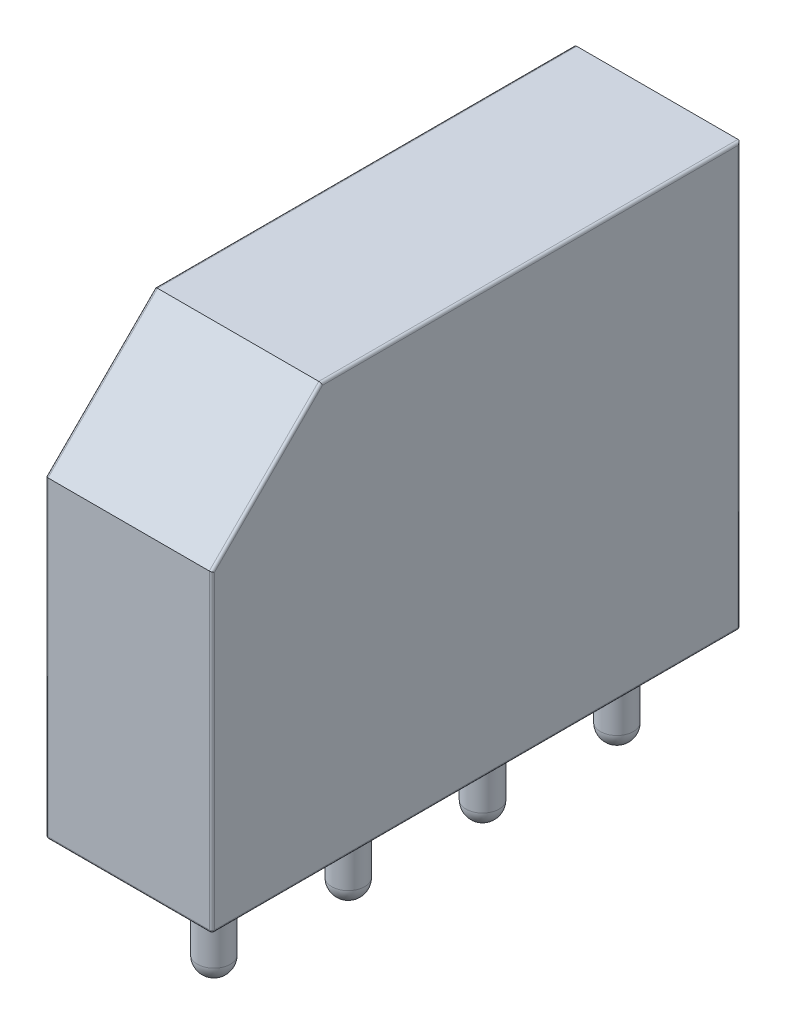
ISO-10303-21;
HEADER;
FILE_DESCRIPTION(('STEP AP214'),'2;1');
FILE_NAME('part.step','',(''),(''),'','','');
FILE_SCHEMA(('AUTOMOTIVE_DESIGN { 1 0 10303 214 1 1 1 1 }'));
ENDSEC;
DATA;
#1=APPLICATION_CONTEXT('core data for automotive mechanical design processes');
#2=APPLICATION_PROTOCOL_DEFINITION('international standard','automotive_design',2000,#1);
#3=PRODUCT_CONTEXT('',#1,'mechanical');
#4=PRODUCT('Part','Part','',(#3));
#5=PRODUCT_RELATED_PRODUCT_CATEGORY('part','',(#4));
#6=PRODUCT_DEFINITION_FORMATION('','',#4);
#7=PRODUCT_DEFINITION_CONTEXT('part definition',#1,'design');
#8=PRODUCT_DEFINITION('design','',#6,#7);
#9=PRODUCT_DEFINITION_SHAPE('','',#8);
#10=(LENGTH_UNIT() NAMED_UNIT(*) SI_UNIT(.MILLI.,.METRE.));
#11=(NAMED_UNIT(*) PLANE_ANGLE_UNIT() SI_UNIT($,.RADIAN.));
#12=(NAMED_UNIT(*) SI_UNIT($,.STERADIAN.) SOLID_ANGLE_UNIT());
#13=UNCERTAINTY_MEASURE_WITH_UNIT(LENGTH_MEASURE(1.E-05),#10,'distance_accuracy_value','');
#14=(GEOMETRIC_REPRESENTATION_CONTEXT(3) GLOBAL_UNCERTAINTY_ASSIGNED_CONTEXT((#13)) GLOBAL_UNIT_ASSIGNED_CONTEXT((#10,
#11,#12)) REPRESENTATION_CONTEXT('',''));
#15=CARTESIAN_POINT('',(0.,0.,0.));
#16=DIRECTION('',(0.,0.,1.));
#17=DIRECTION('',(1.,0.,0.));
#18=AXIS2_PLACEMENT_3D('',#15,#16,#17);
#19=CARTESIAN_POINT('',(-4.,0.,-2.38));
#20=DIRECTION('',(0.,-1.,0.));
#21=DIRECTION('',(0.,0.,-1.));
#22=AXIS2_PLACEMENT_3D('',#19,#20,#21);
#23=PLANE('',#22);
#24=DIRECTION('',(0.,0.,-1.));
#25=VECTOR('',#24,1.);
#26=CARTESIAN_POINT('',(2.2,0.,17.62));
#27=LINE('',#26,#25);
#28=CARTESIAN_POINT('',(2.2,0.,-2.28));
#29=VERTEX_POINT('',#28);
#30=CARTESIAN_POINT('',(2.2,0.,17.52));
#31=VERTEX_POINT('',#30);
#32=EDGE_CURVE('E159',#29,#31,#27,.F.);
#33=ORIENTED_EDGE('',*,*,#32,.T.);
#34=DIRECTION('',(1.,0.,0.));
#35=VECTOR('',#34,1.);
#36=CARTESIAN_POINT('',(-4.,0.,17.52));
#37=LINE('',#36,#35);
#38=CARTESIAN_POINT('',(-3.9,0.,17.52));
#39=VERTEX_POINT('',#38);
#40=EDGE_CURVE('E167',#31,#39,#37,.F.);
#41=ORIENTED_EDGE('',*,*,#40,.T.);
#42=DIRECTION('',(0.,0.,1.));
#43=VECTOR('',#42,1.);
#44=CARTESIAN_POINT('',(-3.9,0.,-2.38));
#45=LINE('',#44,#43);
#46=CARTESIAN_POINT('',(-3.9,0.,-2.28));
#47=VERTEX_POINT('',#46);
#48=EDGE_CURVE('E128',#39,#47,#45,.F.);
#49=ORIENTED_EDGE('',*,*,#48,.T.);
#50=DIRECTION('',(-1.,0.,0.));
#51=VECTOR('',#50,1.);
#52=CARTESIAN_POINT('',(2.3,0.,-2.28));
#53=LINE('',#52,#51);
#54=EDGE_CURVE('E157',#47,#29,#53,.F.);
#55=ORIENTED_EDGE('',*,*,#54,.T.);
#56=EDGE_LOOP('',(#33,#41,#49,#55));
#57=FACE_BOUND('',#56,.T.);
#58=CARTESIAN_POINT('',(0.,0.,10.164));
#59=DIRECTION('',(0.,-1.,0.));
#60=DIRECTION('',(0.,0.,-1.));
#61=AXIS2_PLACEMENT_3D('',#58,#59,#60);
#62=CIRCLE('',#61,0.625000000000001);
#63=CARTESIAN_POINT('',(0.,0.,9.539));
#64=VERTEX_POINT('',#63);
#65=EDGE_CURVE('E249',#64,#64,#62,.T.);
#66=ORIENTED_EDGE('',*,*,#65,.F.);
#67=EDGE_LOOP('',(#66));
#68=FACE_BOUND('',#67,.T.);
#69=CARTESIAN_POINT('',(0.,0.,0.));
#70=DIRECTION('',(0.,-1.,0.));
#71=DIRECTION('',(0.,0.,-1.));
#72=AXIS2_PLACEMENT_3D('',#69,#70,#71);
#73=CIRCLE('',#72,0.625);
#74=CARTESIAN_POINT('',(0.,0.,-0.625));
#75=VERTEX_POINT('',#74);
#76=EDGE_CURVE('E257',#75,#75,#73,.T.);
#77=ORIENTED_EDGE('',*,*,#76,.F.);
#78=EDGE_LOOP('',(#77));
#79=FACE_BOUND('',#78,.T.);
#80=CARTESIAN_POINT('',(0.,0.,5.082));
#81=DIRECTION('',(0.,-1.,0.));
#82=DIRECTION('',(0.,0.,-1.));
#83=AXIS2_PLACEMENT_3D('',#80,#81,#82);
#84=CIRCLE('',#83,0.625);
#85=CARTESIAN_POINT('',(0.,0.,4.457));
#86=VERTEX_POINT('',#85);
#87=EDGE_CURVE('E253',#86,#86,#84,.T.);
#88=ORIENTED_EDGE('',*,*,#87,.F.);
#89=EDGE_LOOP('',(#88));
#90=FACE_BOUND('',#89,.T.);
#91=CARTESIAN_POINT('',(0.,0.,15.246));
#92=DIRECTION('',(0.,-1.,0.));
#93=DIRECTION('',(0.,0.,-1.));
#94=AXIS2_PLACEMENT_3D('',#91,#92,#93);
#95=CIRCLE('',#94,0.625000000000001);
#96=CARTESIAN_POINT('',(0.,0.,14.621));
#97=VERTEX_POINT('',#96);
#98=EDGE_CURVE('E241',#97,#97,#95,.T.);
#99=ORIENTED_EDGE('',*,*,#98,.F.);
#100=EDGE_LOOP('',(#99));
#101=FACE_BOUND('',#100,.T.);
#102=ADVANCED_FACE('F33',(#57,#68,#79,#90,#101),#23,.T.);
#103=CARTESIAN_POINT('',(-4.,16.,17.62));
#104=DIRECTION('',(1.,0.,0.));
#105=DIRECTION('',(0.,0.,-1.));
#106=AXIS2_PLACEMENT_3D('',#103,#104,#105);
#107=PLANE('',#106);
#108=DIRECTION('',(0.,-1.,0.));
#109=VECTOR('',#108,1.);
#110=CARTESIAN_POINT('',(-4.,16.,-2.28));
#111=LINE('',#110,#109);
#112=CARTESIAN_POINT('',(-4.,15.9,-2.28));
#113=VERTEX_POINT('',#112);
#114=CARTESIAN_POINT('',(-4.,0.0999999999999994,-2.28));
#115=VERTEX_POINT('',#114);
#116=EDGE_CURVE('E155',#113,#115,#111,.T.);
#117=ORIENTED_EDGE('',*,*,#116,.T.);
#118=DIRECTION('',(0.,0.,1.));
#119=VECTOR('',#118,1.);
#120=CARTESIAN_POINT('',(-4.,0.0999999999999994,17.62));
#121=LINE('',#120,#119);
#122=CARTESIAN_POINT('',(-4.,0.0999999999999994,17.52));
#123=VERTEX_POINT('',#122);
#124=EDGE_CURVE('E126',#115,#123,#121,.T.);
#125=ORIENTED_EDGE('',*,*,#124,.T.);
#126=DIRECTION('',(0.,-1.,0.));
#127=VECTOR('',#126,1.);
#128=CARTESIAN_POINT('',(-4.,16.,17.52));
#129=LINE('',#128,#127);
#130=CARTESIAN_POINT('',(-4.,11.8171779365371,17.52));
#131=VERTEX_POINT('',#130);
#132=EDGE_CURVE('E144',#123,#131,#129,.F.);
#133=ORIENTED_EDGE('',*,*,#132,.T.);
#134=DIRECTION('',(0.,0.707098244188037,-0.70711531808199));
#135=VECTOR('',#134,1.);
#136=CARTESIAN_POINT('',(-4.,13.8585384687955,15.4785901761848));
#137=LINE('',#136,#135);
#138=CARTESIAN_POINT('',(-4.,15.9,13.4370793509848));
#139=VERTEX_POINT('',#138);
#140=EDGE_CURVE('E150',#131,#139,#137,.T.);
#141=ORIENTED_EDGE('',*,*,#140,.T.);
#142=DIRECTION('',(0.,0.,1.));
#143=VECTOR('',#142,1.);
#144=CARTESIAN_POINT('',(-4.,15.9,17.62));
#145=LINE('',#144,#143);
#146=EDGE_CURVE('E161',#139,#113,#145,.F.);
#147=ORIENTED_EDGE('',*,*,#146,.T.);
#148=EDGE_LOOP('',(#117,#125,#133,#141,#147));
#149=FACE_BOUND('',#148,.T.);
#150=ADVANCED_FACE('F153',(#149),#107,.F.);
#151=CARTESIAN_POINT('',(-4.,16.,17.62));
#152=DIRECTION('',(0.,0.,-1.));
#153=DIRECTION('',(-1.,0.,0.));
#154=AXIS2_PLACEMENT_3D('',#151,#152,#153);
#155=PLANE('',#154);
#156=DIRECTION('',(-1.,0.,0.));
#157=VECTOR('',#156,1.);
#158=CARTESIAN_POINT('',(46.0748308013074,11.8586,17.62));
#159=LINE('',#158,#157);
#160=CARTESIAN_POINT('',(2.19999999999999,11.8586,17.62));
#161=VERTEX_POINT('',#160);
#162=CARTESIAN_POINT('',(-3.9,11.8586,17.62));
#163=VERTEX_POINT('',#162);
#164=EDGE_CURVE('E235',#161,#163,#159,.T.);
#165=ORIENTED_EDGE('',*,*,#164,.T.);
#166=DIRECTION('',(0.,-1.,0.));
#167=VECTOR('',#166,1.);
#168=CARTESIAN_POINT('',(-3.9,16.,17.62));
#169=LINE('',#168,#167);
#170=CARTESIAN_POINT('',(-3.9,0.0999999999999994,17.62));
#171=VERTEX_POINT('',#170);
#172=EDGE_CURVE('E188',#163,#171,#169,.T.);
#173=ORIENTED_EDGE('',*,*,#172,.T.);
#174=DIRECTION('',(1.,0.,0.));
#175=VECTOR('',#174,1.);
#176=CARTESIAN_POINT('',(2.3,0.0999999999999994,17.62));
#177=LINE('',#176,#175);
#178=CARTESIAN_POINT('',(2.2,0.0999999999999994,17.62));
#179=VERTEX_POINT('',#178);
#180=EDGE_CURVE('E184',#171,#179,#177,.T.);
#181=ORIENTED_EDGE('',*,*,#180,.T.);
#182=DIRECTION('',(0.,-1.,0.));
#183=VECTOR('',#182,1.);
#184=CARTESIAN_POINT('',(2.2,16.,17.62));
#185=LINE('',#184,#183);
#186=EDGE_CURVE('E186',#179,#161,#185,.F.);
#187=ORIENTED_EDGE('',*,*,#186,.T.);
#188=EDGE_LOOP('',(#165,#173,#181,#187));
#189=FACE_BOUND('',#188,.T.);
#190=ADVANCED_FACE('F302',(#189),#155,.F.);
#191=CARTESIAN_POINT('',(2.3,16.,17.62));
#192=DIRECTION('',(-1.,0.,0.));
#193=DIRECTION('',(0.,0.,1.));
#194=AXIS2_PLACEMENT_3D('',#191,#192,#193);
#195=PLANE('',#194);
#196=DIRECTION('',(0.,0.,-1.));
#197=VECTOR('',#196,1.);
#198=CARTESIAN_POINT('',(2.3,0.0999999999999994,-2.38));
#199=LINE('',#198,#197);
#200=CARTESIAN_POINT('',(2.3,0.0999999999999994,17.52));
#201=VERTEX_POINT('',#200);
#202=CARTESIAN_POINT('',(2.3,0.0999999999999994,-2.28));
#203=VERTEX_POINT('',#202);
#204=EDGE_CURVE('E42',#201,#203,#199,.T.);
#205=ORIENTED_EDGE('',*,*,#204,.T.);
#206=DIRECTION('',(0.,-1.,0.));
#207=VECTOR('',#206,1.);
#208=CARTESIAN_POINT('',(2.3,16.,-2.28));
#209=LINE('',#208,#207);
#210=CARTESIAN_POINT('',(2.3,15.9,-2.28));
#211=VERTEX_POINT('',#210);
#212=EDGE_CURVE('E11',#203,#211,#209,.F.);
#213=ORIENTED_EDGE('',*,*,#212,.T.);
#214=DIRECTION('',(0.,0.,-1.));
#215=VECTOR('',#214,1.);
#216=CARTESIAN_POINT('',(2.3,15.9,17.62));
#217=LINE('',#216,#215);
#218=CARTESIAN_POINT('',(2.3,15.9,13.4370793509848));
#219=VERTEX_POINT('',#218);
#220=EDGE_CURVE('E190',#211,#219,#217,.F.);
#221=ORIENTED_EDGE('',*,*,#220,.T.);
#222=DIRECTION('',(0.,-0.707098244188037,0.70711531808199));
#223=VECTOR('',#222,1.);
#224=CARTESIAN_POINT('',(2.3,13.8585384687955,15.4785901761848));
#225=LINE('',#224,#223);
#226=CARTESIAN_POINT('',(2.3,11.8171779365371,17.52));
#227=VERTEX_POINT('',#226);
#228=EDGE_CURVE('E192',#219,#227,#225,.T.);
#229=ORIENTED_EDGE('',*,*,#228,.T.);
#230=DIRECTION('',(0.,-1.,0.));
#231=VECTOR('',#230,1.);
#232=CARTESIAN_POINT('',(2.3,16.,17.52));
#233=LINE('',#232,#231);
#234=EDGE_CURVE('E53',#227,#201,#233,.T.);
#235=ORIENTED_EDGE('',*,*,#234,.T.);
#236=EDGE_LOOP('',(#205,#213,#221,#229,#235));
#237=FACE_BOUND('',#236,.T.);
#238=ADVANCED_FACE('F316',(#237),#195,.F.);
#239=CARTESIAN_POINT('',(-4.,16.,-2.38));
#240=DIRECTION('',(0.,0.,1.));
#241=DIRECTION('',(1.,0.,0.));
#242=AXIS2_PLACEMENT_3D('',#239,#240,#241);
#243=PLANE('',#242);
#244=DIRECTION('',(-1.,0.,0.));
#245=VECTOR('',#244,1.);
#246=CARTESIAN_POINT('',(-4.,0.0999999999999994,-2.38));
#247=LINE('',#246,#245);
#248=CARTESIAN_POINT('',(2.2,0.0999999999999994,-2.38));
#249=VERTEX_POINT('',#248);
#250=CARTESIAN_POINT('',(-3.9,0.0999999999999994,-2.38));
#251=VERTEX_POINT('',#250);
#252=EDGE_CURVE('E169',#249,#251,#247,.T.);
#253=ORIENTED_EDGE('',*,*,#252,.T.);
#254=DIRECTION('',(0.,-1.,0.));
#255=VECTOR('',#254,1.);
#256=CARTESIAN_POINT('',(-3.9,16.,-2.38));
#257=LINE('',#256,#255);
#258=CARTESIAN_POINT('',(-3.9,16.,-2.38));
#259=VERTEX_POINT('',#258);
#260=EDGE_CURVE('E173',#251,#259,#257,.F.);
#261=ORIENTED_EDGE('',*,*,#260,.T.);
#262=DIRECTION('',(-1.,0.,0.));
#263=VECTOR('',#262,1.);
#264=CARTESIAN_POINT('',(-4.,16.,-2.38));
#265=LINE('',#264,#263);
#266=CARTESIAN_POINT('',(2.2,16.,-2.38));
#267=VERTEX_POINT('',#266);
#268=EDGE_CURVE('E261',#267,#259,#265,.T.);
#269=ORIENTED_EDGE('',*,*,#268,.F.);
#270=DIRECTION('',(0.,-1.,0.));
#271=VECTOR('',#270,1.);
#272=CARTESIAN_POINT('',(2.2,16.,-2.38));
#273=LINE('',#272,#271);
#274=EDGE_CURVE('E171',#267,#249,#273,.T.);
#275=ORIENTED_EDGE('',*,*,#274,.T.);
#276=EDGE_LOOP('',(#253,#261,#269,#275));
#277=FACE_BOUND('',#276,.T.);
#278=ADVANCED_FACE('F327',(#277),#243,.F.);
#279=CARTESIAN_POINT('',(-4.,16.,-2.38));
#280=DIRECTION('',(0.,-1.,0.));
#281=DIRECTION('',(0.,0.,-1.));
#282=AXIS2_PLACEMENT_3D('',#279,#280,#281);
#283=PLANE('',#282);
#284=ORIENTED_EDGE('',*,*,#268,.T.);
#285=DIRECTION('',(0.,0.,1.));
#286=VECTOR('',#285,1.);
#287=CARTESIAN_POINT('',(-3.9,16.,-2.38));
#288=LINE('',#287,#286);
#289=CARTESIAN_POINT('',(-3.9,16.,13.4785));
#290=VERTEX_POINT('',#289);
#291=EDGE_CURVE('E178',#259,#290,#288,.T.);
#292=ORIENTED_EDGE('',*,*,#291,.T.);
#293=DIRECTION('',(1.,0.,0.));
#294=VECTOR('',#293,1.);
#295=CARTESIAN_POINT('',(-4.,16.,13.4785));
#296=LINE('',#295,#294);
#297=CARTESIAN_POINT('',(2.2,16.,13.4785));
#298=VERTEX_POINT('',#297);
#299=EDGE_CURVE('E151',#290,#298,#296,.T.);
#300=ORIENTED_EDGE('',*,*,#299,.T.);
#301=DIRECTION('',(0.,0.,-1.));
#302=VECTOR('',#301,1.);
#303=CARTESIAN_POINT('',(2.2,16.,-2.38));
#304=LINE('',#303,#302);
#305=EDGE_CURVE('E176',#298,#267,#304,.T.);
#306=ORIENTED_EDGE('',*,*,#305,.T.);
#307=EDGE_LOOP('',(#284,#292,#300,#306));
#308=FACE_BOUND('',#307,.T.);
#309=ADVANCED_FACE('F324',(#308),#283,.F.);
#310=CARTESIAN_POINT('',(0.,-3.,0.));
#311=DIRECTION('',(0.,1.,0.));
#312=DIRECTION('',(0.,0.,1.));
#313=AXIS2_PLACEMENT_3D('',#310,#311,#312);
#314=CYLINDRICAL_SURFACE('',#313,0.625);
#315=CARTESIAN_POINT('',(0.,-3.,0.));
#316=DIRECTION('',(0.,-1.,0.));
#317=DIRECTION('',(0.,0.,-1.));
#318=AXIS2_PLACEMENT_3D('',#315,#316,#317);
#319=CIRCLE('',#318,0.625);
#320=CARTESIAN_POINT('',(0.,-3.,-0.625));
#321=VERTEX_POINT('',#320);
#322=EDGE_CURVE('E260',#321,#321,#319,.T.);
#323=ORIENTED_EDGE('',*,*,#322,.F.);
#324=EDGE_LOOP('',(#323));
#325=FACE_BOUND('',#324,.T.);
#326=ORIENTED_EDGE('',*,*,#76,.T.);
#327=EDGE_LOOP('',(#326));
#328=FACE_BOUND('',#327,.T.);
#329=ADVANCED_FACE('F334',(#325,#328),#314,.T.);
#330=CARTESIAN_POINT('',(0.,-3.,0.));
#331=DIRECTION('',(0.,0.,1.));
#332=DIRECTION('',(1.,0.,0.));
#333=AXIS2_PLACEMENT_3D('',#330,#331,#332);
#334=SPHERICAL_SURFACE('',#333,0.625);
#335=CARTESIAN_POINT('',(0.,-3.,0.));
#336=DIRECTION('',(0.,-1.,0.));
#337=DIRECTION('',(0.,0.,-1.));
#338=AXIS2_PLACEMENT_3D('',#335,#336,#337);
#339=SPHERICAL_SURFACE('',#338,0.625);
#340=ORIENTED_EDGE('',*,*,#322,.T.);
#341=EDGE_LOOP('',(#340));
#342=FACE_BOUND('',#341,.T.);
#343=ADVANCED_FACE('F346',(#342),#339,.T.);
#344=CARTESIAN_POINT('',(0.,-3.,5.082));
#345=DIRECTION('',(0.,1.,0.));
#346=DIRECTION('',(0.,0.,1.));
#347=AXIS2_PLACEMENT_3D('',#344,#345,#346);
#348=CYLINDRICAL_SURFACE('',#347,0.625);
#349=CARTESIAN_POINT('',(0.,-3.,5.082));
#350=DIRECTION('',(0.,-1.,0.));
#351=DIRECTION('',(0.,0.,-1.));
#352=AXIS2_PLACEMENT_3D('',#349,#350,#351);
#353=CIRCLE('',#352,0.625);
#354=CARTESIAN_POINT('',(0.,-3.,4.457));
#355=VERTEX_POINT('',#354);
#356=EDGE_CURVE('E256',#355,#355,#353,.T.);
#357=ORIENTED_EDGE('',*,*,#356,.F.);
#358=EDGE_LOOP('',(#357));
#359=FACE_BOUND('',#358,.T.);
#360=ORIENTED_EDGE('',*,*,#87,.T.);
#361=EDGE_LOOP('',(#360));
#362=FACE_BOUND('',#361,.T.);
#363=ADVANCED_FACE('F348',(#359,#362),#348,.T.);
#364=CARTESIAN_POINT('',(0.,-3.,5.082));
#365=DIRECTION('',(0.,0.,1.));
#366=DIRECTION('',(1.,0.,0.));
#367=AXIS2_PLACEMENT_3D('',#364,#365,#366);
#368=SPHERICAL_SURFACE('',#367,0.625);
#369=CARTESIAN_POINT('',(0.,-3.,5.082));
#370=DIRECTION('',(0.,-1.,0.));
#371=DIRECTION('',(0.,0.,-1.));
#372=AXIS2_PLACEMENT_3D('',#369,#370,#371);
#373=SPHERICAL_SURFACE('',#372,0.625);
#374=ORIENTED_EDGE('',*,*,#356,.T.);
#375=EDGE_LOOP('',(#374));
#376=FACE_BOUND('',#375,.T.);
#377=ADVANCED_FACE('F351',(#376),#373,.T.);
#378=CARTESIAN_POINT('',(0.,-3.,10.164));
#379=DIRECTION('',(0.,1.,0.));
#380=DIRECTION('',(0.,0.,1.));
#381=AXIS2_PLACEMENT_3D('',#378,#379,#380);
#382=CYLINDRICAL_SURFACE('',#381,0.625000000000001);
#383=CARTESIAN_POINT('',(0.,-3.,10.164));
#384=DIRECTION('',(0.,-1.,0.));
#385=DIRECTION('',(0.,0.,-1.));
#386=AXIS2_PLACEMENT_3D('',#383,#384,#385);
#387=CIRCLE('',#386,0.625000000000001);
#388=CARTESIAN_POINT('',(0.,-3.,9.539));
#389=VERTEX_POINT('',#388);
#390=EDGE_CURVE('E252',#389,#389,#387,.T.);
#391=ORIENTED_EDGE('',*,*,#390,.F.);
#392=EDGE_LOOP('',(#391));
#393=FACE_BOUND('',#392,.T.);
#394=ORIENTED_EDGE('',*,*,#65,.T.);
#395=EDGE_LOOP('',(#394));
#396=FACE_BOUND('',#395,.T.);
#397=ADVANCED_FACE('F353',(#393,#396),#382,.T.);
#398=CARTESIAN_POINT('',(0.,-3.,10.164));
#399=DIRECTION('',(0.,0.,1.));
#400=DIRECTION('',(1.,0.,0.));
#401=AXIS2_PLACEMENT_3D('',#398,#399,#400);
#402=SPHERICAL_SURFACE('',#401,0.625000000000001);
#403=CARTESIAN_POINT('',(0.,-3.,10.164));
#404=DIRECTION('',(0.,-1.,0.));
#405=DIRECTION('',(0.,0.,-1.));
#406=AXIS2_PLACEMENT_3D('',#403,#404,#405);
#407=SPHERICAL_SURFACE('',#406,0.625000000000001);
#408=ORIENTED_EDGE('',*,*,#390,.T.);
#409=EDGE_LOOP('',(#408));
#410=FACE_BOUND('',#409,.T.);
#411=ADVANCED_FACE('F356',(#410),#407,.T.);
#412=CARTESIAN_POINT('',(0.,-3.,15.246));
#413=DIRECTION('',(0.,1.,0.));
#414=DIRECTION('',(0.,0.,1.));
#415=AXIS2_PLACEMENT_3D('',#412,#413,#414);
#416=CYLINDRICAL_SURFACE('',#415,0.625000000000001);
#417=CARTESIAN_POINT('',(0.,-3.,15.246));
#418=DIRECTION('',(0.,-1.,0.));
#419=DIRECTION('',(0.,0.,-1.));
#420=AXIS2_PLACEMENT_3D('',#417,#418,#419);
#421=CIRCLE('',#420,0.625000000000001);
#422=CARTESIAN_POINT('',(0.,-3.,14.621));
#423=VERTEX_POINT('',#422);
#424=EDGE_CURVE('E246',#423,#423,#421,.T.);
#425=ORIENTED_EDGE('',*,*,#424,.F.);
#426=EDGE_LOOP('',(#425));
#427=FACE_BOUND('',#426,.T.);
#428=ORIENTED_EDGE('',*,*,#98,.T.);
#429=EDGE_LOOP('',(#428));
#430=FACE_BOUND('',#429,.T.);
#431=ADVANCED_FACE('F358',(#427,#430),#416,.T.);
#432=CARTESIAN_POINT('',(0.,-3.,15.246));
#433=DIRECTION('',(0.,0.,1.));
#434=DIRECTION('',(1.,0.,0.));
#435=AXIS2_PLACEMENT_3D('',#432,#433,#434);
#436=SPHERICAL_SURFACE('',#435,0.625000000000001);
#437=CARTESIAN_POINT('',(0.,-3.,15.246));
#438=DIRECTION('',(0.,-1.,0.));
#439=DIRECTION('',(0.,0.,-1.));
#440=AXIS2_PLACEMENT_3D('',#437,#438,#439);
#441=SPHERICAL_SURFACE('',#440,0.625000000000001);
#442=ORIENTED_EDGE('',*,*,#424,.T.);
#443=EDGE_LOOP('',(#442));
#444=FACE_BOUND('',#443,.T.);
#445=ADVANCED_FACE('F361',(#444),#441,.T.);
#446=CARTESIAN_POINT('',(46.0748308013074,16.,13.4785));
#447=DIRECTION('',(0.,-0.70711531808199,-0.707098244188037));
#448=DIRECTION('',(0.,0.707098244188037,-0.70711531808199));
#449=AXIS2_PLACEMENT_3D('',#446,#447,#448);
#450=PLANE('',#449);
#451=ORIENTED_EDGE('',*,*,#299,.F.);
#452=DIRECTION('',(0.,0.707098244188037,-0.70711531808199));
#453=VECTOR('',#452,1.);
#454=CARTESIAN_POINT('',(-3.9,16.,13.4785));
#455=LINE('',#454,#453);
#456=EDGE_CURVE('E182',#290,#163,#455,.F.);
#457=ORIENTED_EDGE('',*,*,#456,.T.);
#458=ORIENTED_EDGE('',*,*,#164,.F.);
#459=DIRECTION('',(0.,-0.707098244188037,0.70711531808199));
#460=VECTOR('',#459,1.);
#461=CARTESIAN_POINT('',(2.2,16.,13.4785));
#462=LINE('',#461,#460);
#463=EDGE_CURVE('E180',#161,#298,#462,.F.);
#464=ORIENTED_EDGE('',*,*,#463,.T.);
#465=EDGE_LOOP('',(#451,#457,#458,#464));
#466=FACE_BOUND('',#465,.T.);
#467=ADVANCED_FACE('F322',(#466),#450,.F.);
#468=CARTESIAN_POINT('',(2.2,15.9,-2.38));
#469=DIRECTION('',(0.,0.,-1.));
#470=DIRECTION('',(-1.,0.,0.));
#471=AXIS2_PLACEMENT_3D('',#468,#469,#470);
#472=CYLINDRICAL_SURFACE('',#471,0.1);
#473=CARTESIAN_POINT('',(2.2,15.9,-2.28));
#474=DIRECTION('',(0.,-0.707106781186547,-0.707106781186547));
#475=DIRECTION('',(0.,0.707106781186547,-0.707106781186547));
#476=AXIS2_PLACEMENT_3D('',#473,#474,#475);
#477=ELLIPSE('',#476,0.14142135623731,0.1);
#478=EDGE_CURVE('E229',#267,#211,#477,.T.);
#479=ORIENTED_EDGE('',*,*,#478,.F.);
#480=ORIENTED_EDGE('',*,*,#305,.F.);
#481=CARTESIAN_POINT('',(2.2,15.9,13.4370793509848));
#482=DIRECTION('',(0.,0.382677855328741,-0.923881842575659));
#483=DIRECTION('',(0.,-0.923881842575659,-0.382677855328741));
#484=AXIS2_PLACEMENT_3D('',#481,#482,#483);
#485=ELLIPSE('',#484,0.10823894938904,0.1);
#486=EDGE_CURVE('E37',#219,#298,#485,.F.);
#487=ORIENTED_EDGE('',*,*,#486,.F.);
#488=ORIENTED_EDGE('',*,*,#220,.F.);
#489=EDGE_LOOP('',(#479,#480,#487,#488));
#490=FACE_BOUND('',#489,.T.);
#491=ADVANCED_FACE('F35',(#490),#472,.T.);
#492=CARTESIAN_POINT('',(2.2,13.8585384687955,15.4785901761848));
#493=DIRECTION('',(0.,-0.707098244188037,0.70711531808199));
#494=DIRECTION('',(0.,-0.70711531808199,-0.707098244188037));
#495=AXIS2_PLACEMENT_3D('',#492,#493,#494);
#496=CYLINDRICAL_SURFACE('',#495,0.1);
#497=ORIENTED_EDGE('',*,*,#486,.T.);
#498=ORIENTED_EDGE('',*,*,#463,.F.);
#499=CARTESIAN_POINT('',(2.2,11.8171779365371,17.52));
#500=DIRECTION('',(0.,-0.923877222413249,0.382689009387494));
#501=DIRECTION('',(0.,0.382689009387494,0.923877222413248));
#502=AXIS2_PLACEMENT_3D('',#499,#500,#501);
#503=ELLIPSE('',#502,0.108239490674736,0.1);
#504=EDGE_CURVE('E227',#227,#161,#503,.T.);
#505=ORIENTED_EDGE('',*,*,#504,.F.);
#506=ORIENTED_EDGE('',*,*,#228,.F.);
#507=EDGE_LOOP('',(#497,#498,#505,#506));
#508=FACE_BOUND('',#507,.T.);
#509=ADVANCED_FACE('F319',(#508),#496,.T.);
#510=CARTESIAN_POINT('',(2.2,16.,-2.28));
#511=DIRECTION('',(0.,-1.,0.));
#512=DIRECTION('',(0.,0.,-1.));
#513=AXIS2_PLACEMENT_3D('',#510,#511,#512);
#514=CYLINDRICAL_SURFACE('',#513,0.1);
#515=ORIENTED_EDGE('',*,*,#478,.T.);
#516=ORIENTED_EDGE('',*,*,#212,.F.);
#517=CARTESIAN_POINT('',(2.2,0.0999999999999994,-2.28));
#518=DIRECTION('',(0.,-1.,0.));
#519=DIRECTION('',(0.,0.,-1.));
#520=AXIS2_PLACEMENT_3D('',#517,#518,#519);
#521=CIRCLE('',#520,0.1);
#522=EDGE_CURVE('E221',#249,#203,#521,.T.);
#523=ORIENTED_EDGE('',*,*,#522,.F.);
#524=ORIENTED_EDGE('',*,*,#274,.F.);
#525=EDGE_LOOP('',(#515,#516,#523,#524));
#526=FACE_BOUND('',#525,.T.);
#527=ADVANCED_FACE('F315',(#526),#514,.T.);
#528=CARTESIAN_POINT('',(2.2,16.,17.52));
#529=DIRECTION('',(0.,-1.,0.));
#530=DIRECTION('',(0.,0.,-1.));
#531=AXIS2_PLACEMENT_3D('',#528,#529,#530);
#532=CYLINDRICAL_SURFACE('',#531,0.1);
#533=ORIENTED_EDGE('',*,*,#504,.T.);
#534=ORIENTED_EDGE('',*,*,#186,.F.);
#535=CARTESIAN_POINT('',(2.2,0.0999999999999994,17.52));
#536=DIRECTION('',(0.,-1.,0.));
#537=DIRECTION('',(0.,0.,-1.));
#538=AXIS2_PLACEMENT_3D('',#535,#536,#537);
#539=CIRCLE('',#538,0.1);
#540=EDGE_CURVE('E215',#201,#179,#539,.T.);
#541=ORIENTED_EDGE('',*,*,#540,.F.);
#542=ORIENTED_EDGE('',*,*,#234,.F.);
#543=EDGE_LOOP('',(#533,#534,#541,#542));
#544=FACE_BOUND('',#543,.T.);
#545=ADVANCED_FACE('F305',(#544),#532,.T.);
#546=CARTESIAN_POINT('',(2.2,0.0999999999999994,17.62));
#547=DIRECTION('',(0.,0.,1.));
#548=DIRECTION('',(1.,0.,0.));
#549=AXIS2_PLACEMENT_3D('',#546,#547,#548);
#550=CYLINDRICAL_SURFACE('',#549,0.1);
#551=CARTESIAN_POINT('',(2.2,0.0999999999999994,-2.28));
#552=DIRECTION('',(0.,0.,-1.));
#553=DIRECTION('',(-1.,0.,0.));
#554=AXIS2_PLACEMENT_3D('',#551,#552,#553);
#555=CIRCLE('',#554,0.1);
#556=EDGE_CURVE('E224',#203,#29,#555,.T.);
#557=ORIENTED_EDGE('',*,*,#556,.F.);
#558=ORIENTED_EDGE('',*,*,#204,.F.);
#559=CARTESIAN_POINT('',(2.2,0.1,17.52));
#560=DIRECTION('',(0.,0.,1.));
#561=DIRECTION('',(1.,0.,0.));
#562=AXIS2_PLACEMENT_3D('',#559,#560,#561);
#563=CIRCLE('',#562,0.1);
#564=EDGE_CURVE('E212',#31,#201,#563,.T.);
#565=ORIENTED_EDGE('',*,*,#564,.F.);
#566=ORIENTED_EDGE('',*,*,#32,.F.);
#567=EDGE_LOOP('',(#557,#558,#565,#566));
#568=FACE_BOUND('',#567,.T.);
#569=ADVANCED_FACE('F311',(#568),#550,.T.);
#570=CARTESIAN_POINT('',(2.2,0.1,-2.28));
#571=DIRECTION('',(0.,0.,1.));
#572=DIRECTION('',(1.,0.,0.));
#573=AXIS2_PLACEMENT_3D('',#570,#571,#572);
#574=SPHERICAL_SURFACE('',#573,0.1);
#575=ORIENTED_EDGE('',*,*,#522,.T.);
#576=ORIENTED_EDGE('',*,*,#556,.T.);
#577=CARTESIAN_POINT('',(2.2,0.1,-2.28));
#578=DIRECTION('',(1.,0.,0.));
#579=DIRECTION('',(0.,0.,-1.));
#580=AXIS2_PLACEMENT_3D('',#577,#578,#579);
#581=CIRCLE('',#580,0.1);
#582=EDGE_CURVE('E209',#249,#29,#581,.F.);
#583=ORIENTED_EDGE('',*,*,#582,.F.);
#584=EDGE_LOOP('',(#575,#576,#583));
#585=FACE_BOUND('',#584,.T.);
#586=ADVANCED_FACE('F314',(#585),#574,.T.);
#587=CARTESIAN_POINT('',(-3.9,15.9,-2.38));
#588=DIRECTION('',(0.,0.,1.));
#589=DIRECTION('',(1.,0.,0.));
#590=AXIS2_PLACEMENT_3D('',#587,#588,#589);
#591=CYLINDRICAL_SURFACE('',#590,0.1);
#592=CARTESIAN_POINT('',(-3.9,15.9,-2.28));
#593=DIRECTION('',(0.,0.707106781186547,0.707106781186547));
#594=DIRECTION('',(0.,-0.707106781186547,0.707106781186547));
#595=AXIS2_PLACEMENT_3D('',#592,#593,#594);
#596=ELLIPSE('',#595,0.14142135623731,0.1);
#597=EDGE_CURVE('E207',#113,#259,#596,.F.);
#598=ORIENTED_EDGE('',*,*,#597,.F.);
#599=ORIENTED_EDGE('',*,*,#146,.F.);
#600=CARTESIAN_POINT('',(-3.9,15.9,13.4370793509848));
#601=DIRECTION('',(0.,0.382677855328741,-0.923881842575659));
#602=DIRECTION('',(0.,0.923881842575659,0.382677855328741));
#603=AXIS2_PLACEMENT_3D('',#600,#601,#602);
#604=ELLIPSE('',#603,0.10823894938904,0.1);
#605=EDGE_CURVE('E218',#290,#139,#604,.F.);
#606=ORIENTED_EDGE('',*,*,#605,.F.);
#607=ORIENTED_EDGE('',*,*,#291,.F.);
#608=EDGE_LOOP('',(#598,#599,#606,#607));
#609=FACE_BOUND('',#608,.T.);
#610=ADVANCED_FACE('F279',(#609),#591,.T.);
#611=CARTESIAN_POINT('',(-3.9,13.8585384687955,15.4785901761848));
#612=DIRECTION('',(0.,0.707098244188037,-0.70711531808199));
#613=DIRECTION('',(0.,0.70711531808199,0.707098244188037));
#614=AXIS2_PLACEMENT_3D('',#611,#612,#613);
#615=CYLINDRICAL_SURFACE('',#614,0.1);
#616=ORIENTED_EDGE('',*,*,#605,.T.);
#617=ORIENTED_EDGE('',*,*,#140,.F.);
#618=CARTESIAN_POINT('',(-3.9,11.8171779365371,17.52));
#619=DIRECTION('',(0.,-0.923877222413249,0.382689009387494));
#620=DIRECTION('',(0.,-0.382689009387494,-0.923877222413248));
#621=AXIS2_PLACEMENT_3D('',#618,#619,#620);
#622=ELLIPSE('',#621,0.108239490674736,0.1);
#623=EDGE_CURVE('E147',#163,#131,#622,.T.);
#624=ORIENTED_EDGE('',*,*,#623,.F.);
#625=ORIENTED_EDGE('',*,*,#456,.F.);
#626=EDGE_LOOP('',(#616,#617,#624,#625));
#627=FACE_BOUND('',#626,.T.);
#628=ADVANCED_FACE('F399',(#627),#615,.T.);
#629=CARTESIAN_POINT('',(2.2,0.1,17.52));
#630=DIRECTION('',(0.,0.,1.));
#631=DIRECTION('',(1.,0.,0.));
#632=AXIS2_PLACEMENT_3D('',#629,#630,#631);
#633=SPHERICAL_SURFACE('',#632,0.1);
#634=ORIENTED_EDGE('',*,*,#564,.T.);
#635=ORIENTED_EDGE('',*,*,#540,.T.);
#636=CARTESIAN_POINT('',(2.2,0.0999999999999994,17.52));
#637=DIRECTION('',(1.,0.,0.));
#638=DIRECTION('',(0.,0.,-1.));
#639=AXIS2_PLACEMENT_3D('',#636,#637,#638);
#640=CIRCLE('',#639,0.1);
#641=EDGE_CURVE('E203',#31,#179,#640,.F.);
#642=ORIENTED_EDGE('',*,*,#641,.F.);
#643=EDGE_LOOP('',(#634,#635,#642));
#644=FACE_BOUND('',#643,.T.);
#645=ADVANCED_FACE('F308',(#644),#633,.T.);
#646=CARTESIAN_POINT('',(-4.,0.0999999999999994,-2.28));
#647=DIRECTION('',(1.,0.,0.));
#648=DIRECTION('',(0.,0.,-1.));
#649=AXIS2_PLACEMENT_3D('',#646,#647,#648);
#650=CYLINDRICAL_SURFACE('',#649,0.1);
#651=ORIENTED_EDGE('',*,*,#582,.T.);
#652=ORIENTED_EDGE('',*,*,#54,.F.);
#653=CARTESIAN_POINT('',(-3.9,0.0999999999999994,-2.28));
#654=DIRECTION('',(-1.,0.,0.));
#655=DIRECTION('',(0.,0.,1.));
#656=AXIS2_PLACEMENT_3D('',#653,#654,#655);
#657=CIRCLE('',#656,0.1);
#658=EDGE_CURVE('E200',#251,#47,#657,.T.);
#659=ORIENTED_EDGE('',*,*,#658,.F.);
#660=ORIENTED_EDGE('',*,*,#252,.F.);
#661=EDGE_LOOP('',(#651,#652,#659,#660));
#662=FACE_BOUND('',#661,.T.);
#663=ADVANCED_FACE('F290',(#662),#650,.T.);
#664=CARTESIAN_POINT('',(-3.9,16.,-2.28));
#665=DIRECTION('',(0.,-1.,0.));
#666=DIRECTION('',(0.,0.,-1.));
#667=AXIS2_PLACEMENT_3D('',#664,#665,#666);
#668=CYLINDRICAL_SURFACE('',#667,0.1);
#669=ORIENTED_EDGE('',*,*,#597,.T.);
#670=ORIENTED_EDGE('',*,*,#260,.F.);
#671=CARTESIAN_POINT('',(-3.9,0.0999999999999994,-2.28));
#672=DIRECTION('',(0.,-1.,0.));
#673=DIRECTION('',(0.,0.,-1.));
#674=AXIS2_PLACEMENT_3D('',#671,#672,#673);
#675=CIRCLE('',#674,0.1);
#676=EDGE_CURVE('E141',#115,#251,#675,.T.);
#677=ORIENTED_EDGE('',*,*,#676,.F.);
#678=ORIENTED_EDGE('',*,*,#116,.F.);
#679=EDGE_LOOP('',(#669,#670,#677,#678));
#680=FACE_BOUND('',#679,.T.);
#681=ADVANCED_FACE('F282',(#680),#668,.T.);
#682=CARTESIAN_POINT('',(-3.9,16.,17.52));
#683=DIRECTION('',(0.,-1.,0.));
#684=DIRECTION('',(0.,0.,-1.));
#685=AXIS2_PLACEMENT_3D('',#682,#683,#684);
#686=CYLINDRICAL_SURFACE('',#685,0.1);
#687=ORIENTED_EDGE('',*,*,#623,.T.);
#688=ORIENTED_EDGE('',*,*,#132,.F.);
#689=CARTESIAN_POINT('',(-3.9,0.0999999999999994,17.52));
#690=DIRECTION('',(0.,-1.,0.));
#691=DIRECTION('',(0.,0.,-1.));
#692=AXIS2_PLACEMENT_3D('',#689,#690,#691);
#693=CIRCLE('',#692,0.1);
#694=EDGE_CURVE('E134',#171,#123,#693,.T.);
#695=ORIENTED_EDGE('',*,*,#694,.F.);
#696=ORIENTED_EDGE('',*,*,#172,.F.);
#697=EDGE_LOOP('',(#687,#688,#695,#696));
#698=FACE_BOUND('',#697,.T.);
#699=ADVANCED_FACE('F145',(#698),#686,.T.);
#700=CARTESIAN_POINT('',(-4.,0.0999999999999994,17.52));
#701=DIRECTION('',(-1.,0.,0.));
#702=DIRECTION('',(0.,0.,1.));
#703=AXIS2_PLACEMENT_3D('',#700,#701,#702);
#704=CYLINDRICAL_SURFACE('',#703,0.1);
#705=ORIENTED_EDGE('',*,*,#641,.T.);
#706=ORIENTED_EDGE('',*,*,#180,.F.);
#707=CARTESIAN_POINT('',(-3.9,0.1,17.52));
#708=DIRECTION('',(-1.,0.,0.));
#709=DIRECTION('',(0.,0.,1.));
#710=AXIS2_PLACEMENT_3D('',#707,#708,#709);
#711=CIRCLE('',#710,0.1);
#712=EDGE_CURVE('E138',#39,#171,#711,.T.);
#713=ORIENTED_EDGE('',*,*,#712,.F.);
#714=ORIENTED_EDGE('',*,*,#40,.F.);
#715=EDGE_LOOP('',(#705,#706,#713,#714));
#716=FACE_BOUND('',#715,.T.);
#717=ADVANCED_FACE('F299',(#716),#704,.T.);
#718=CARTESIAN_POINT('',(-3.9,0.1,-2.28));
#719=DIRECTION('',(0.,0.,1.));
#720=DIRECTION('',(1.,0.,0.));
#721=AXIS2_PLACEMENT_3D('',#718,#719,#720);
#722=SPHERICAL_SURFACE('',#721,0.1);
#723=ORIENTED_EDGE('',*,*,#676,.T.);
#724=ORIENTED_EDGE('',*,*,#658,.T.);
#725=CARTESIAN_POINT('',(-3.9,0.1,-2.28));
#726=DIRECTION('',(0.,0.,-1.));
#727=DIRECTION('',(-1.,0.,0.));
#728=AXIS2_PLACEMENT_3D('',#725,#726,#727);
#729=CIRCLE('',#728,0.1);
#730=EDGE_CURVE('E131',#115,#47,#729,.F.);
#731=ORIENTED_EDGE('',*,*,#730,.F.);
#732=EDGE_LOOP('',(#723,#724,#731));
#733=FACE_BOUND('',#732,.T.);
#734=ADVANCED_FACE('F286',(#733),#722,.T.);
#735=CARTESIAN_POINT('',(-3.9,0.1,17.52));
#736=DIRECTION('',(0.,0.,1.));
#737=DIRECTION('',(1.,0.,0.));
#738=AXIS2_PLACEMENT_3D('',#735,#736,#737);
#739=SPHERICAL_SURFACE('',#738,0.1);
#740=ORIENTED_EDGE('',*,*,#712,.T.);
#741=ORIENTED_EDGE('',*,*,#694,.T.);
#742=CARTESIAN_POINT('',(-3.9,0.0999999999999994,17.52));
#743=DIRECTION('',(0.,0.,1.));
#744=DIRECTION('',(1.,0.,0.));
#745=AXIS2_PLACEMENT_3D('',#742,#743,#744);
#746=CIRCLE('',#745,0.1);
#747=EDGE_CURVE('E122',#39,#123,#746,.F.);
#748=ORIENTED_EDGE('',*,*,#747,.F.);
#749=EDGE_LOOP('',(#740,#741,#748));
#750=FACE_BOUND('',#749,.T.);
#751=ADVANCED_FACE('F136',(#750),#739,.T.);
#752=CARTESIAN_POINT('',(-3.9,0.0999999999999994,17.62));
#753=DIRECTION('',(0.,0.,-1.));
#754=DIRECTION('',(-1.,0.,0.));
#755=AXIS2_PLACEMENT_3D('',#752,#753,#754);
#756=CYLINDRICAL_SURFACE('',#755,0.1);
#757=ORIENTED_EDGE('',*,*,#730,.T.);
#758=ORIENTED_EDGE('',*,*,#48,.F.);
#759=ORIENTED_EDGE('',*,*,#747,.T.);
#760=ORIENTED_EDGE('',*,*,#124,.F.);
#761=EDGE_LOOP('',(#757,#758,#759,#760));
#762=FACE_BOUND('',#761,.T.);
#763=ADVANCED_FACE('F124',(#762),#756,.T.);
#764=CLOSED_SHELL('',(#102,#150,#190,#238,#278,#309,#329,#343,#363,#377,#397,#411,#431,#445,
#467,#491,#509,#527,#545,#569,#586,#610,#628,#645,#663,#681,#699,#717,#734,#751,#763));
#765=MANIFOLD_SOLID_BREP('B2',#764);
#766=ADVANCED_BREP_SHAPE_REPRESENTATION('',(#18,#765),#14);
#767=SHAPE_DEFINITION_REPRESENTATION(#9,#766);
ENDSEC;
END-ISO-10303-21;
